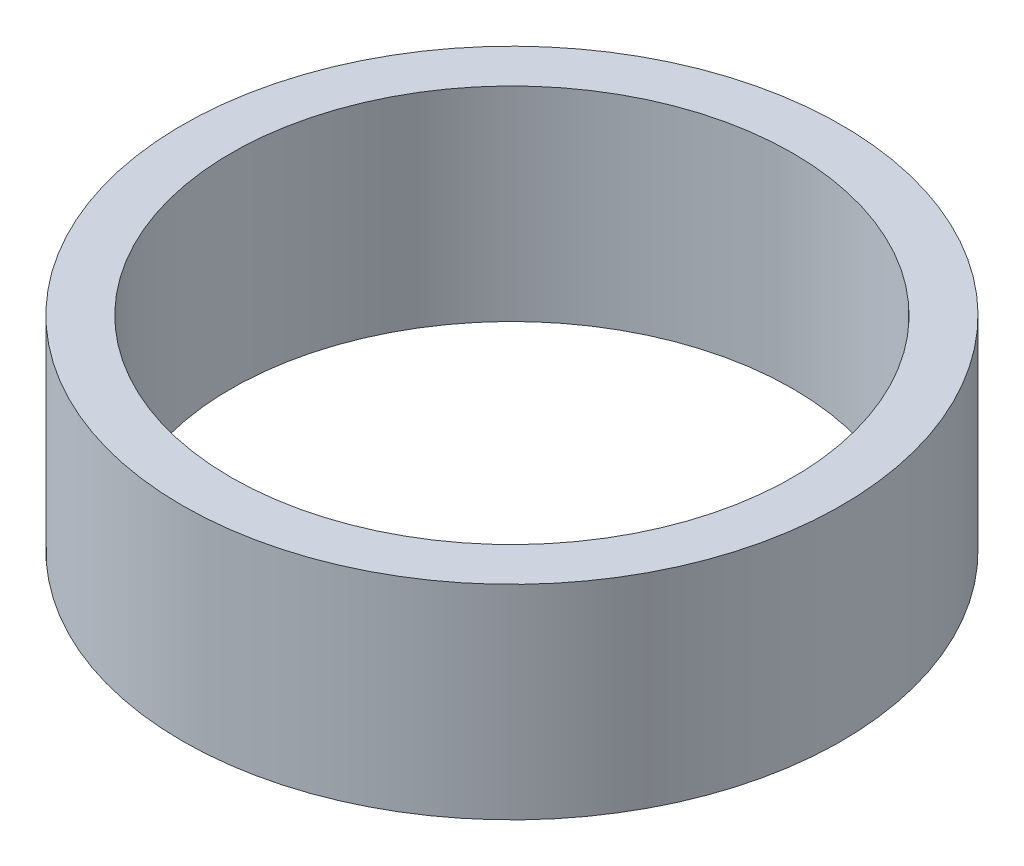
ISO-10303-21;
HEADER;
FILE_DESCRIPTION(('STEP AP214'),'2;1');
FILE_NAME('part.step','',(''),(''),'','','');
FILE_SCHEMA(('AUTOMOTIVE_DESIGN { 1 0 10303 214 1 1 1 1 }'));
ENDSEC;
DATA;
#1=APPLICATION_CONTEXT('core data for automotive mechanical design processes');
#2=APPLICATION_PROTOCOL_DEFINITION('international standard','automotive_design',2000,#1);
#3=PRODUCT_CONTEXT('',#1,'mechanical');
#4=PRODUCT('Part','Part','',(#3));
#5=PRODUCT_RELATED_PRODUCT_CATEGORY('part','',(#4));
#6=PRODUCT_DEFINITION_FORMATION('','',#4);
#7=PRODUCT_DEFINITION_CONTEXT('part definition',#1,'design');
#8=PRODUCT_DEFINITION('design','',#6,#7);
#9=PRODUCT_DEFINITION_SHAPE('','',#8);
#10=(LENGTH_UNIT() NAMED_UNIT(*) SI_UNIT(.MILLI.,.METRE.));
#11=(NAMED_UNIT(*) PLANE_ANGLE_UNIT() SI_UNIT($,.RADIAN.));
#12=(NAMED_UNIT(*) SI_UNIT($,.STERADIAN.) SOLID_ANGLE_UNIT());
#13=UNCERTAINTY_MEASURE_WITH_UNIT(LENGTH_MEASURE(1.E-05),#10,'distance_accuracy_value','');
#14=(GEOMETRIC_REPRESENTATION_CONTEXT(3) GLOBAL_UNCERTAINTY_ASSIGNED_CONTEXT((#13)) GLOBAL_UNIT_ASSIGNED_CONTEXT((#10,
#11,#12)) REPRESENTATION_CONTEXT('',''));
#15=CARTESIAN_POINT('',(0.,0.,0.));
#16=DIRECTION('',(0.,0.,1.));
#17=DIRECTION('',(1.,0.,0.));
#18=AXIS2_PLACEMENT_3D('',#15,#16,#17);
#19=CARTESIAN_POINT('',(0.,21.6630705516116,0.));
#20=DIRECTION('',(0.,-1.,0.));
#21=DIRECTION('',(0.,0.,-1.));
#22=AXIS2_PLACEMENT_3D('',#19,#20,#21);
#23=CYLINDRICAL_SURFACE('',#22,35.);
#24=CARTESIAN_POINT('',(0.,21.6630705516116,0.));
#25=DIRECTION('',(0.,1.,0.));
#26=DIRECTION('',(0.,0.,1.));
#27=AXIS2_PLACEMENT_3D('',#24,#25,#26);
#28=CIRCLE('',#27,35.);
#29=CARTESIAN_POINT('',(0.,21.6630705516116,35.));
#30=VERTEX_POINT('',#29);
#31=EDGE_CURVE('E10',#30,#30,#28,.T.);
#32=ORIENTED_EDGE('',*,*,#31,.F.);
#33=EDGE_LOOP('',(#32));
#34=FACE_BOUND('',#33,.T.);
#35=CARTESIAN_POINT('',(0.,0.,0.));
#36=DIRECTION('',(0.,1.,0.));
#37=DIRECTION('',(0.,0.,1.));
#38=AXIS2_PLACEMENT_3D('',#35,#36,#37);
#39=CIRCLE('',#38,35.);
#40=CARTESIAN_POINT('',(0.,0.,35.));
#41=VERTEX_POINT('',#40);
#42=EDGE_CURVE('E37',#41,#41,#39,.T.);
#43=ORIENTED_EDGE('',*,*,#42,.T.);
#44=EDGE_LOOP('',(#43));
#45=FACE_BOUND('',#44,.T.);
#46=ADVANCED_FACE('F40',(#34,#45),#23,.T.);
#47=CARTESIAN_POINT('',(0.,21.6630705516116,0.));
#48=DIRECTION('',(0.,1.,0.));
#49=DIRECTION('',(0.,0.,1.));
#50=AXIS2_PLACEMENT_3D('',#47,#48,#49);
#51=PLANE('',#50);
#52=CARTESIAN_POINT('',(0.,21.6630705516116,0.));
#53=DIRECTION('',(0.,1.,0.));
#54=DIRECTION('',(0.,0.,1.));
#55=AXIS2_PLACEMENT_3D('',#52,#53,#54);
#56=CIRCLE('',#55,29.8253871985539);
#57=CARTESIAN_POINT('',(0.,21.6630705516116,29.8253871985539));
#58=VERTEX_POINT('',#57);
#59=EDGE_CURVE('E50',#58,#58,#56,.T.);
#60=ORIENTED_EDGE('',*,*,#59,.F.);
#61=EDGE_LOOP('',(#60));
#62=FACE_BOUND('',#61,.T.);
#63=ORIENTED_EDGE('',*,*,#31,.T.);
#64=EDGE_LOOP('',(#63));
#65=FACE_BOUND('',#64,.T.);
#66=ADVANCED_FACE('F59',(#62,#65),#51,.T.);
#67=CARTESIAN_POINT('',(0.,0.,0.));
#68=DIRECTION('',(0.,1.,0.));
#69=DIRECTION('',(0.,0.,1.));
#70=AXIS2_PLACEMENT_3D('',#67,#68,#69);
#71=PLANE('',#70);
#72=CARTESIAN_POINT('',(0.,0.,0.));
#73=DIRECTION('',(0.,1.,0.));
#74=DIRECTION('',(0.,0.,1.));
#75=AXIS2_PLACEMENT_3D('',#72,#73,#74);
#76=CIRCLE('',#75,29.8253871985539);
#77=CARTESIAN_POINT('',(0.,0.,29.8253871985539));
#78=VERTEX_POINT('',#77);
#79=EDGE_CURVE('E47',#78,#78,#76,.T.);
#80=ORIENTED_EDGE('',*,*,#79,.T.);
#81=EDGE_LOOP('',(#80));
#82=FACE_BOUND('',#81,.T.);
#83=ORIENTED_EDGE('',*,*,#42,.F.);
#84=EDGE_LOOP('',(#83));
#85=FACE_BOUND('',#84,.T.);
#86=ADVANCED_FACE('F58',(#82,#85),#71,.F.);
#87=CARTESIAN_POINT('',(0.,21.6630705516116,0.));
#88=DIRECTION('',(0.,-1.,0.));
#89=DIRECTION('',(0.,0.,-1.));
#90=AXIS2_PLACEMENT_3D('',#87,#88,#89);
#91=CYLINDRICAL_SURFACE('',#90,29.8253871985539);
#92=ORIENTED_EDGE('',*,*,#59,.T.);
#93=EDGE_LOOP('',(#92));
#94=FACE_BOUND('',#93,.T.);
#95=ORIENTED_EDGE('',*,*,#79,.F.);
#96=EDGE_LOOP('',(#95));
#97=FACE_BOUND('',#96,.T.);
#98=ADVANCED_FACE('F54',(#94,#97),#91,.F.);
#99=CLOSED_SHELL('',(#46,#66,#86,#98));
#100=MANIFOLD_SOLID_BREP('B2',#99);
#101=ADVANCED_BREP_SHAPE_REPRESENTATION('',(#18,#100),#14);
#102=SHAPE_DEFINITION_REPRESENTATION(#9,#101);
ENDSEC;
END-ISO-10303-21;
